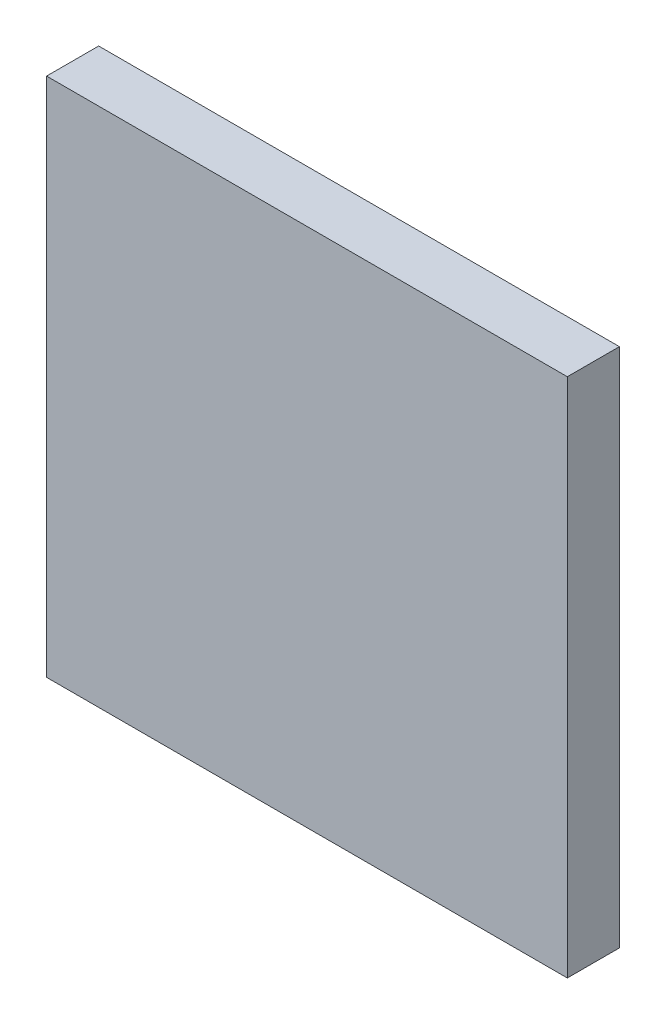
ISO-10303-21;
HEADER;
FILE_DESCRIPTION(('STEP AP214'),'2;1');
FILE_NAME('part.step','',(''),(''),'','','');
FILE_SCHEMA(('AUTOMOTIVE_DESIGN { 1 0 10303 214 1 1 1 1 }'));
ENDSEC;
DATA;
#1=APPLICATION_CONTEXT('core data for automotive mechanical design processes');
#2=APPLICATION_PROTOCOL_DEFINITION('international standard','automotive_design',2000,#1);
#3=PRODUCT_CONTEXT('',#1,'mechanical');
#4=PRODUCT('Part','Part','',(#3));
#5=PRODUCT_RELATED_PRODUCT_CATEGORY('part','',(#4));
#6=PRODUCT_DEFINITION_FORMATION('','',#4);
#7=PRODUCT_DEFINITION_CONTEXT('part definition',#1,'design');
#8=PRODUCT_DEFINITION('design','',#6,#7);
#9=PRODUCT_DEFINITION_SHAPE('','',#8);
#10=(LENGTH_UNIT() NAMED_UNIT(*) SI_UNIT(.MILLI.,.METRE.));
#11=(NAMED_UNIT(*) PLANE_ANGLE_UNIT() SI_UNIT($,.RADIAN.));
#12=(NAMED_UNIT(*) SI_UNIT($,.STERADIAN.) SOLID_ANGLE_UNIT());
#13=UNCERTAINTY_MEASURE_WITH_UNIT(LENGTH_MEASURE(1.E-05),#10,'distance_accuracy_value','');
#14=(GEOMETRIC_REPRESENTATION_CONTEXT(3) GLOBAL_UNCERTAINTY_ASSIGNED_CONTEXT((#13)) GLOBAL_UNIT_ASSIGNED_CONTEXT((#10,
#11,#12)) REPRESENTATION_CONTEXT('',''));
#15=CARTESIAN_POINT('',(0.,0.,0.));
#16=DIRECTION('',(0.,0.,1.));
#17=DIRECTION('',(1.,0.,0.));
#18=AXIS2_PLACEMENT_3D('',#15,#16,#17);
#19=CARTESIAN_POINT('',(50.,-50.,10.));
#20=DIRECTION('',(-1.,0.,0.));
#21=DIRECTION('',(0.,0.,1.));
#22=AXIS2_PLACEMENT_3D('',#19,#20,#21);
#23=PLANE('',#22);
#24=DIRECTION('',(0.,1.,0.));
#25=VECTOR('',#24,1.);
#26=CARTESIAN_POINT('',(50.,-50.,0.));
#27=LINE('',#26,#25);
#28=CARTESIAN_POINT('',(50.,-50.,0.));
#29=VERTEX_POINT('',#28);
#30=CARTESIAN_POINT('',(50.,50.,0.));
#31=VERTEX_POINT('',#30);
#32=EDGE_CURVE('E107',#29,#31,#27,.T.);
#33=ORIENTED_EDGE('',*,*,#32,.T.);
#34=DIRECTION('',(0.,0.,-1.));
#35=VECTOR('',#34,1.);
#36=CARTESIAN_POINT('',(50.,50.,10.));
#37=LINE('',#36,#35);
#38=CARTESIAN_POINT('',(50.,50.,10.));
#39=VERTEX_POINT('',#38);
#40=EDGE_CURVE('E11',#39,#31,#37,.T.);
#41=ORIENTED_EDGE('',*,*,#40,.F.);
#42=DIRECTION('',(0.,1.,0.));
#43=VECTOR('',#42,1.);
#44=CARTESIAN_POINT('',(50.,-50.,10.));
#45=LINE('',#44,#43);
#46=CARTESIAN_POINT('',(50.,-50.,10.));
#47=VERTEX_POINT('',#46);
#48=EDGE_CURVE('E91',#47,#39,#45,.T.);
#49=ORIENTED_EDGE('',*,*,#48,.F.);
#50=DIRECTION('',(0.,0.,-1.));
#51=VECTOR('',#50,1.);
#52=CARTESIAN_POINT('',(50.,-50.,10.));
#53=LINE('',#52,#51);
#54=EDGE_CURVE('E103',#47,#29,#53,.T.);
#55=ORIENTED_EDGE('',*,*,#54,.T.);
#56=EDGE_LOOP('',(#33,#41,#49,#55));
#57=FACE_BOUND('',#56,.T.);
#58=ADVANCED_FACE('F39',(#57),#23,.F.);
#59=CARTESIAN_POINT('',(-50.,50.,10.));
#60=DIRECTION('',(0.,-1.,0.));
#61=DIRECTION('',(0.,0.,-1.));
#62=AXIS2_PLACEMENT_3D('',#59,#60,#61);
#63=PLANE('',#62);
#64=DIRECTION('',(-1.,0.,0.));
#65=VECTOR('',#64,1.);
#66=CARTESIAN_POINT('',(-50.,50.,0.));
#67=LINE('',#66,#65);
#68=CARTESIAN_POINT('',(-50.,50.,0.));
#69=VERTEX_POINT('',#68);
#70=EDGE_CURVE('E96',#31,#69,#67,.T.);
#71=ORIENTED_EDGE('',*,*,#70,.T.);
#72=DIRECTION('',(0.,0.,-1.));
#73=VECTOR('',#72,1.);
#74=CARTESIAN_POINT('',(-50.,50.,10.));
#75=LINE('',#74,#73);
#76=CARTESIAN_POINT('',(-50.,50.,10.));
#77=VERTEX_POINT('',#76);
#78=EDGE_CURVE('E48',#77,#69,#75,.T.);
#79=ORIENTED_EDGE('',*,*,#78,.F.);
#80=DIRECTION('',(-1.,0.,0.));
#81=VECTOR('',#80,1.);
#82=CARTESIAN_POINT('',(-50.,50.,10.));
#83=LINE('',#82,#81);
#84=EDGE_CURVE('E86',#39,#77,#83,.T.);
#85=ORIENTED_EDGE('',*,*,#84,.F.);
#86=ORIENTED_EDGE('',*,*,#40,.T.);
#87=EDGE_LOOP('',(#71,#79,#85,#86));
#88=FACE_BOUND('',#87,.T.);
#89=ADVANCED_FACE('F95',(#88),#63,.F.);
#90=CARTESIAN_POINT('',(-50.,-50.,10.));
#91=DIRECTION('',(1.,0.,0.));
#92=DIRECTION('',(0.,0.,-1.));
#93=AXIS2_PLACEMENT_3D('',#90,#91,#92);
#94=PLANE('',#93);
#95=DIRECTION('',(0.,-1.,0.));
#96=VECTOR('',#95,1.);
#97=CARTESIAN_POINT('',(-50.,-50.,0.));
#98=LINE('',#97,#96);
#99=CARTESIAN_POINT('',(-50.,-50.,0.));
#100=VERTEX_POINT('',#99);
#101=EDGE_CURVE('E73',#69,#100,#98,.T.);
#102=ORIENTED_EDGE('',*,*,#101,.T.);
#103=DIRECTION('',(0.,0.,-1.));
#104=VECTOR('',#103,1.);
#105=CARTESIAN_POINT('',(-50.,-50.,10.));
#106=LINE('',#105,#104);
#107=CARTESIAN_POINT('',(-50.,-50.,10.));
#108=VERTEX_POINT('',#107);
#109=EDGE_CURVE('E98',#108,#100,#106,.T.);
#110=ORIENTED_EDGE('',*,*,#109,.F.);
#111=DIRECTION('',(0.,-1.,0.));
#112=VECTOR('',#111,1.);
#113=CARTESIAN_POINT('',(-50.,-50.,10.));
#114=LINE('',#113,#112);
#115=EDGE_CURVE('E89',#77,#108,#114,.T.);
#116=ORIENTED_EDGE('',*,*,#115,.F.);
#117=ORIENTED_EDGE('',*,*,#78,.T.);
#118=EDGE_LOOP('',(#102,#110,#116,#117));
#119=FACE_BOUND('',#118,.T.);
#120=ADVANCED_FACE('F99',(#119),#94,.F.);
#121=CARTESIAN_POINT('',(-50.,-50.,10.));
#122=DIRECTION('',(0.,1.,0.));
#123=DIRECTION('',(0.,0.,1.));
#124=AXIS2_PLACEMENT_3D('',#121,#122,#123);
#125=PLANE('',#124);
#126=DIRECTION('',(1.,0.,0.));
#127=VECTOR('',#126,1.);
#128=CARTESIAN_POINT('',(-50.,-50.,0.));
#129=LINE('',#128,#127);
#130=EDGE_CURVE('E79',#100,#29,#129,.T.);
#131=ORIENTED_EDGE('',*,*,#130,.T.);
#132=ORIENTED_EDGE('',*,*,#54,.F.);
#133=DIRECTION('',(1.,0.,0.));
#134=VECTOR('',#133,1.);
#135=CARTESIAN_POINT('',(-50.,-50.,10.));
#136=LINE('',#135,#134);
#137=EDGE_CURVE('E56',#108,#47,#136,.T.);
#138=ORIENTED_EDGE('',*,*,#137,.F.);
#139=ORIENTED_EDGE('',*,*,#109,.T.);
#140=EDGE_LOOP('',(#131,#132,#138,#139));
#141=FACE_BOUND('',#140,.T.);
#142=ADVANCED_FACE('F120',(#141),#125,.F.);
#143=CARTESIAN_POINT('',(0.,0.,10.));
#144=DIRECTION('',(0.,0.,-1.));
#145=DIRECTION('',(-1.,0.,0.));
#146=AXIS2_PLACEMENT_3D('',#143,#144,#145);
#147=PLANE('',#146);
#148=ORIENTED_EDGE('',*,*,#48,.T.);
#149=ORIENTED_EDGE('',*,*,#84,.T.);
#150=ORIENTED_EDGE('',*,*,#115,.T.);
#151=ORIENTED_EDGE('',*,*,#137,.T.);
#152=EDGE_LOOP('',(#148,#149,#150,#151));
#153=FACE_BOUND('',#152,.T.);
#154=ADVANCED_FACE('F87',(#153),#147,.F.);
#155=CARTESIAN_POINT('',(0.,0.,0.));
#156=DIRECTION('',(0.,0.,-1.));
#157=DIRECTION('',(-1.,0.,0.));
#158=AXIS2_PLACEMENT_3D('',#155,#156,#157);
#159=PLANE('',#158);
#160=ORIENTED_EDGE('',*,*,#32,.F.);
#161=ORIENTED_EDGE('',*,*,#130,.F.);
#162=ORIENTED_EDGE('',*,*,#101,.F.);
#163=ORIENTED_EDGE('',*,*,#70,.F.);
#164=EDGE_LOOP('',(#160,#161,#162,#163));
#165=FACE_BOUND('',#164,.T.);
#166=ADVANCED_FACE('F123',(#165),#159,.T.);
#167=CLOSED_SHELL('',(#58,#89,#120,#142,#154,#166));
#168=MANIFOLD_SOLID_BREP('B2',#167);
#169=ADVANCED_BREP_SHAPE_REPRESENTATION('',(#18,#168),#14);
#170=SHAPE_DEFINITION_REPRESENTATION(#9,#169);
ENDSEC;
END-ISO-10303-21;
